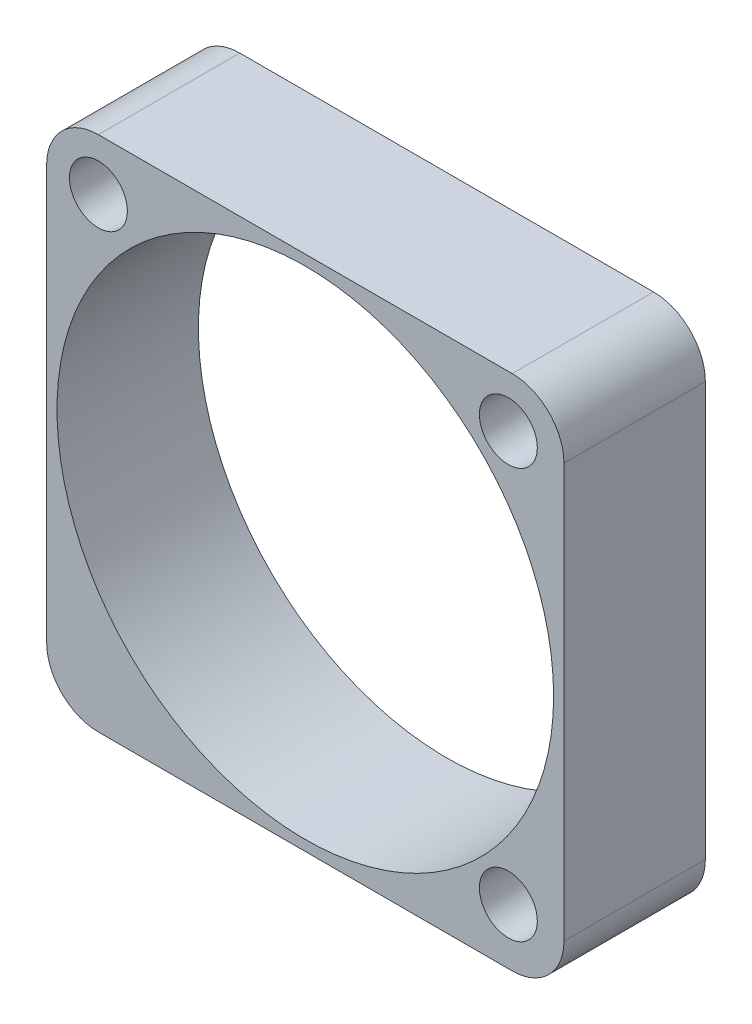
ISO-10303-21;
HEADER;
FILE_DESCRIPTION(('STEP AP214'),'2;1');
FILE_NAME('part.step','',(''),(''),'','','');
FILE_SCHEMA(('AUTOMOTIVE_DESIGN { 1 0 10303 214 1 1 1 1 }'));
ENDSEC;
DATA;
#1=APPLICATION_CONTEXT('core data for automotive mechanical design processes');
#2=APPLICATION_PROTOCOL_DEFINITION('international standard','automotive_design',2000,#1);
#3=PRODUCT_CONTEXT('',#1,'mechanical');
#4=PRODUCT('Part','Part','',(#3));
#5=PRODUCT_RELATED_PRODUCT_CATEGORY('part','',(#4));
#6=PRODUCT_DEFINITION_FORMATION('','',#4);
#7=PRODUCT_DEFINITION_CONTEXT('part definition',#1,'design');
#8=PRODUCT_DEFINITION('design','',#6,#7);
#9=PRODUCT_DEFINITION_SHAPE('','',#8);
#10=(LENGTH_UNIT() NAMED_UNIT(*) SI_UNIT(.MILLI.,.METRE.));
#11=(NAMED_UNIT(*) PLANE_ANGLE_UNIT() SI_UNIT($,.RADIAN.));
#12=(NAMED_UNIT(*) SI_UNIT($,.STERADIAN.) SOLID_ANGLE_UNIT());
#13=UNCERTAINTY_MEASURE_WITH_UNIT(LENGTH_MEASURE(1.E-05),#10,'distance_accuracy_value','');
#14=(GEOMETRIC_REPRESENTATION_CONTEXT(3) GLOBAL_UNCERTAINTY_ASSIGNED_CONTEXT((#13)) GLOBAL_UNIT_ASSIGNED_CONTEXT((#10,
#11,#12)) REPRESENTATION_CONTEXT('',''));
#15=CARTESIAN_POINT('',(0.,0.,0.));
#16=DIRECTION('',(0.,0.,1.));
#17=DIRECTION('',(1.,0.,0.));
#18=AXIS2_PLACEMENT_3D('',#15,#16,#17);
#19=CARTESIAN_POINT('',(0.,0.,6.8325));
#20=DIRECTION('',(1.,0.,0.));
#21=DIRECTION('',(0.,0.,-1.));
#22=AXIS2_PLACEMENT_3D('',#19,#20,#21);
#23=PLANE('',#22);
#24=DIRECTION('',(0.,-1.,0.));
#25=VECTOR('',#24,1.);
#26=CARTESIAN_POINT('',(0.,0.,0.));
#27=LINE('',#26,#25);
#28=CARTESIAN_POINT('',(0.,22.5,0.));
#29=VERTEX_POINT('',#28);
#30=CARTESIAN_POINT('',(0.,2.5,0.));
#31=VERTEX_POINT('',#30);
#32=EDGE_CURVE('E127',#29,#31,#27,.T.);
#33=ORIENTED_EDGE('',*,*,#32,.T.);
#34=DIRECTION('',(0.,0.,-1.));
#35=VECTOR('',#34,1.);
#36=CARTESIAN_POINT('',(0.,2.5,6.8325));
#37=LINE('',#36,#35);
#38=CARTESIAN_POINT('',(0.,2.5,6.8325));
#39=VERTEX_POINT('',#38);
#40=EDGE_CURVE('E105',#31,#39,#37,.F.);
#41=ORIENTED_EDGE('',*,*,#40,.T.);
#42=DIRECTION('',(0.,-1.,0.));
#43=VECTOR('',#42,1.);
#44=CARTESIAN_POINT('',(0.,0.,6.8325));
#45=LINE('',#44,#43);
#46=CARTESIAN_POINT('',(0.,22.5,6.8325));
#47=VERTEX_POINT('',#46);
#48=EDGE_CURVE('E137',#47,#39,#45,.T.);
#49=ORIENTED_EDGE('',*,*,#48,.F.);
#50=DIRECTION('',(0.,0.,-1.));
#51=VECTOR('',#50,1.);
#52=CARTESIAN_POINT('',(0.,22.5,6.8325));
#53=LINE('',#52,#51);
#54=EDGE_CURVE('E110',#47,#29,#53,.T.);
#55=ORIENTED_EDGE('',*,*,#54,.T.);
#56=EDGE_LOOP('',(#33,#41,#49,#55));
#57=FACE_BOUND('',#56,.T.);
#58=ADVANCED_FACE('F34',(#57),#23,.F.);
#59=CARTESIAN_POINT('',(0.,0.,6.8325));
#60=DIRECTION('',(0.,1.,0.));
#61=DIRECTION('',(0.,0.,1.));
#62=AXIS2_PLACEMENT_3D('',#59,#60,#61);
#63=PLANE('',#62);
#64=DIRECTION('',(1.,0.,0.));
#65=VECTOR('',#64,1.);
#66=CARTESIAN_POINT('',(0.,0.,6.8325));
#67=LINE('',#66,#65);
#68=CARTESIAN_POINT('',(2.5,0.,6.8325));
#69=VERTEX_POINT('',#68);
#70=CARTESIAN_POINT('',(22.5,0.,6.8325));
#71=VERTEX_POINT('',#70);
#72=EDGE_CURVE('E120',#69,#71,#67,.T.);
#73=ORIENTED_EDGE('',*,*,#72,.F.);
#74=DIRECTION('',(0.,0.,-1.));
#75=VECTOR('',#74,1.);
#76=CARTESIAN_POINT('',(2.5,0.,6.8325));
#77=LINE('',#76,#75);
#78=CARTESIAN_POINT('',(2.5,0.,0.));
#79=VERTEX_POINT('',#78);
#80=EDGE_CURVE('E104',#69,#79,#77,.T.);
#81=ORIENTED_EDGE('',*,*,#80,.T.);
#82=DIRECTION('',(1.,0.,0.));
#83=VECTOR('',#82,1.);
#84=CARTESIAN_POINT('',(0.,0.,0.));
#85=LINE('',#84,#83);
#86=CARTESIAN_POINT('',(22.5,0.,0.));
#87=VERTEX_POINT('',#86);
#88=EDGE_CURVE('E117',#79,#87,#85,.T.);
#89=ORIENTED_EDGE('',*,*,#88,.T.);
#90=DIRECTION('',(0.,0.,-1.));
#91=VECTOR('',#90,1.);
#92=CARTESIAN_POINT('',(22.5,0.,6.8325));
#93=LINE('',#92,#91);
#94=EDGE_CURVE('E122',#87,#71,#93,.F.);
#95=ORIENTED_EDGE('',*,*,#94,.T.);
#96=EDGE_LOOP('',(#73,#81,#89,#95));
#97=FACE_BOUND('',#96,.T.);
#98=ADVANCED_FACE('F116',(#97),#63,.F.);
#99=CARTESIAN_POINT('',(25.,0.,6.8325));
#100=DIRECTION('',(-1.,0.,0.));
#101=DIRECTION('',(0.,0.,1.));
#102=AXIS2_PLACEMENT_3D('',#99,#100,#101);
#103=PLANE('',#102);
#104=DIRECTION('',(0.,1.,0.));
#105=VECTOR('',#104,1.);
#106=CARTESIAN_POINT('',(25.,0.,6.8325));
#107=LINE('',#106,#105);
#108=CARTESIAN_POINT('',(25.,2.5,6.8325));
#109=VERTEX_POINT('',#108);
#110=CARTESIAN_POINT('',(25.,22.5,6.8325));
#111=VERTEX_POINT('',#110);
#112=EDGE_CURVE('E163',#109,#111,#107,.T.);
#113=ORIENTED_EDGE('',*,*,#112,.F.);
#114=DIRECTION('',(0.,0.,-1.));
#115=VECTOR('',#114,1.);
#116=CARTESIAN_POINT('',(25.,2.5,6.8325));
#117=LINE('',#116,#115);
#118=CARTESIAN_POINT('',(25.,2.5,0.));
#119=VERTEX_POINT('',#118);
#120=EDGE_CURVE('E156',#109,#119,#117,.T.);
#121=ORIENTED_EDGE('',*,*,#120,.T.);
#122=DIRECTION('',(0.,1.,0.));
#123=VECTOR('',#122,1.);
#124=CARTESIAN_POINT('',(25.,0.,0.));
#125=LINE('',#124,#123);
#126=CARTESIAN_POINT('',(25.,22.5,0.));
#127=VERTEX_POINT('',#126);
#128=EDGE_CURVE('E126',#119,#127,#125,.T.);
#129=ORIENTED_EDGE('',*,*,#128,.T.);
#130=DIRECTION('',(0.,0.,-1.));
#131=VECTOR('',#130,1.);
#132=CARTESIAN_POINT('',(25.,22.5,6.8325));
#133=LINE('',#132,#131);
#134=EDGE_CURVE('E154',#127,#111,#133,.F.);
#135=ORIENTED_EDGE('',*,*,#134,.T.);
#136=EDGE_LOOP('',(#113,#121,#129,#135));
#137=FACE_BOUND('',#136,.T.);
#138=ADVANCED_FACE('F161',(#137),#103,.F.);
#139=CARTESIAN_POINT('',(0.,25.,6.8325));
#140=DIRECTION('',(0.,-1.,0.));
#141=DIRECTION('',(0.,0.,-1.));
#142=AXIS2_PLACEMENT_3D('',#139,#140,#141);
#143=PLANE('',#142);
#144=DIRECTION('',(-1.,0.,0.));
#145=VECTOR('',#144,1.);
#146=CARTESIAN_POINT('',(0.,25.,6.8325));
#147=LINE('',#146,#145);
#148=CARTESIAN_POINT('',(22.5,25.,6.8325));
#149=VERTEX_POINT('',#148);
#150=CARTESIAN_POINT('',(2.5,25.,6.8325));
#151=VERTEX_POINT('',#150);
#152=EDGE_CURVE('E138',#149,#151,#147,.T.);
#153=ORIENTED_EDGE('',*,*,#152,.F.);
#154=DIRECTION('',(0.,0.,-1.));
#155=VECTOR('',#154,1.);
#156=CARTESIAN_POINT('',(22.5,25.,6.8325));
#157=LINE('',#156,#155);
#158=CARTESIAN_POINT('',(22.5,25.,0.));
#159=VERTEX_POINT('',#158);
#160=EDGE_CURVE('E11',#149,#159,#157,.T.);
#161=ORIENTED_EDGE('',*,*,#160,.T.);
#162=DIRECTION('',(-1.,0.,0.));
#163=VECTOR('',#162,1.);
#164=CARTESIAN_POINT('',(0.,25.,0.));
#165=LINE('',#164,#163);
#166=CARTESIAN_POINT('',(2.5,25.,0.));
#167=VERTEX_POINT('',#166);
#168=EDGE_CURVE('E130',#159,#167,#165,.T.);
#169=ORIENTED_EDGE('',*,*,#168,.T.);
#170=DIRECTION('',(0.,0.,-1.));
#171=VECTOR('',#170,1.);
#172=CARTESIAN_POINT('',(2.5,25.,6.8325));
#173=LINE('',#172,#171);
#174=EDGE_CURVE('E42',#167,#151,#173,.F.);
#175=ORIENTED_EDGE('',*,*,#174,.T.);
#176=EDGE_LOOP('',(#153,#161,#169,#175));
#177=FACE_BOUND('',#176,.T.);
#178=ADVANCED_FACE('F170',(#177),#143,.F.);
#179=CARTESIAN_POINT('',(0.,0.,6.8325));
#180=DIRECTION('',(0.,0.,-1.));
#181=DIRECTION('',(-1.,0.,0.));
#182=AXIS2_PLACEMENT_3D('',#179,#180,#181);
#183=PLANE('',#182);
#184=CARTESIAN_POINT('',(22.312,2.68799999999999,6.8325));
#185=DIRECTION('',(0.,0.,1.));
#186=DIRECTION('',(1.,0.,0.));
#187=AXIS2_PLACEMENT_3D('',#184,#185,#186);
#188=CIRCLE('',#187,1.4);
#189=CARTESIAN_POINT('',(23.712,2.68799999999999,6.8325));
#190=VERTEX_POINT('',#189);
#191=EDGE_CURVE('E195',#190,#190,#188,.T.);
#192=ORIENTED_EDGE('',*,*,#191,.F.);
#193=EDGE_LOOP('',(#192));
#194=FACE_BOUND('',#193,.T.);
#195=CARTESIAN_POINT('',(22.312,22.5,6.8325));
#196=DIRECTION('',(0.,0.,1.));
#197=DIRECTION('',(1.,0.,0.));
#198=AXIS2_PLACEMENT_3D('',#195,#196,#197);
#199=CIRCLE('',#198,1.4);
#200=CARTESIAN_POINT('',(23.712,22.5,6.8325));
#201=VERTEX_POINT('',#200);
#202=EDGE_CURVE('E189',#201,#201,#199,.T.);
#203=ORIENTED_EDGE('',*,*,#202,.F.);
#204=EDGE_LOOP('',(#203));
#205=FACE_BOUND('',#204,.T.);
#206=CARTESIAN_POINT('',(2.5,22.5,6.8325));
#207=DIRECTION('',(0.,0.,1.));
#208=DIRECTION('',(1.,0.,0.));
#209=AXIS2_PLACEMENT_3D('',#206,#207,#208);
#210=CIRCLE('',#209,1.4);
#211=CARTESIAN_POINT('',(3.9,22.5,6.8325));
#212=VERTEX_POINT('',#211);
#213=EDGE_CURVE('E183',#212,#212,#210,.T.);
#214=ORIENTED_EDGE('',*,*,#213,.F.);
#215=EDGE_LOOP('',(#214));
#216=FACE_BOUND('',#215,.T.);
#217=CARTESIAN_POINT('',(12.5,12.5,6.8325));
#218=DIRECTION('',(0.,0.,1.));
#219=DIRECTION('',(1.,0.,0.));
#220=AXIS2_PLACEMENT_3D('',#217,#218,#219);
#221=CIRCLE('',#220,12.);
#222=CARTESIAN_POINT('',(24.5,12.5,6.8325));
#223=VERTEX_POINT('',#222);
#224=EDGE_CURVE('E177',#223,#223,#221,.T.);
#225=ORIENTED_EDGE('',*,*,#224,.F.);
#226=EDGE_LOOP('',(#225));
#227=FACE_BOUND('',#226,.T.);
#228=ORIENTED_EDGE('',*,*,#48,.T.);
#229=CARTESIAN_POINT('',(2.5,2.5,6.8325));
#230=DIRECTION('',(0.,0.,-1.));
#231=DIRECTION('',(-1.,0.,0.));
#232=AXIS2_PLACEMENT_3D('',#229,#230,#231);
#233=CIRCLE('',#232,2.5);
#234=EDGE_CURVE('E152',#39,#69,#233,.F.);
#235=ORIENTED_EDGE('',*,*,#234,.T.);
#236=ORIENTED_EDGE('',*,*,#72,.T.);
#237=CARTESIAN_POINT('',(22.5,2.5,6.8325));
#238=DIRECTION('',(0.,0.,-1.));
#239=DIRECTION('',(-1.,0.,0.));
#240=AXIS2_PLACEMENT_3D('',#237,#238,#239);
#241=CIRCLE('',#240,2.5);
#242=EDGE_CURVE('E150',#71,#109,#241,.F.);
#243=ORIENTED_EDGE('',*,*,#242,.T.);
#244=ORIENTED_EDGE('',*,*,#112,.T.);
#245=CARTESIAN_POINT('',(22.5,22.5,6.8325));
#246=DIRECTION('',(0.,0.,-1.));
#247=DIRECTION('',(-1.,0.,0.));
#248=AXIS2_PLACEMENT_3D('',#245,#246,#247);
#249=CIRCLE('',#248,2.5);
#250=EDGE_CURVE('E55',#111,#149,#249,.F.);
#251=ORIENTED_EDGE('',*,*,#250,.T.);
#252=ORIENTED_EDGE('',*,*,#152,.T.);
#253=CARTESIAN_POINT('',(2.5,22.5,6.8325));
#254=DIRECTION('',(0.,0.,-1.));
#255=DIRECTION('',(-1.,0.,0.));
#256=AXIS2_PLACEMENT_3D('',#253,#254,#255);
#257=CIRCLE('',#256,2.5);
#258=EDGE_CURVE('E147',#151,#47,#257,.F.);
#259=ORIENTED_EDGE('',*,*,#258,.T.);
#260=EDGE_LOOP('',(#228,#235,#236,#243,#244,#251,#252,#259));
#261=FACE_BOUND('',#260,.T.);
#262=ADVANCED_FACE('F210',(#194,#205,#216,#227,#261),#183,.F.);
#263=CARTESIAN_POINT('',(0.,0.,0.));
#264=DIRECTION('',(0.,0.,-1.));
#265=DIRECTION('',(-1.,0.,0.));
#266=AXIS2_PLACEMENT_3D('',#263,#264,#265);
#267=PLANE('',#266);
#268=CARTESIAN_POINT('',(22.312,2.68799999999999,0.));
#269=DIRECTION('',(0.,0.,1.));
#270=DIRECTION('',(1.,0.,0.));
#271=AXIS2_PLACEMENT_3D('',#268,#269,#270);
#272=CIRCLE('',#271,1.4);
#273=CARTESIAN_POINT('',(23.712,2.68799999999999,0.));
#274=VERTEX_POINT('',#273);
#275=EDGE_CURVE('E192',#274,#274,#272,.T.);
#276=ORIENTED_EDGE('',*,*,#275,.T.);
#277=EDGE_LOOP('',(#276));
#278=FACE_BOUND('',#277,.T.);
#279=CARTESIAN_POINT('',(22.312,22.5,0.));
#280=DIRECTION('',(0.,0.,1.));
#281=DIRECTION('',(1.,0.,0.));
#282=AXIS2_PLACEMENT_3D('',#279,#280,#281);
#283=CIRCLE('',#282,1.4);
#284=CARTESIAN_POINT('',(23.712,22.5,0.));
#285=VERTEX_POINT('',#284);
#286=EDGE_CURVE('E186',#285,#285,#283,.T.);
#287=ORIENTED_EDGE('',*,*,#286,.T.);
#288=EDGE_LOOP('',(#287));
#289=FACE_BOUND('',#288,.T.);
#290=CARTESIAN_POINT('',(2.5,22.5,0.));
#291=DIRECTION('',(0.,0.,1.));
#292=DIRECTION('',(1.,0.,0.));
#293=AXIS2_PLACEMENT_3D('',#290,#291,#292);
#294=CIRCLE('',#293,1.4);
#295=CARTESIAN_POINT('',(3.9,22.5,0.));
#296=VERTEX_POINT('',#295);
#297=EDGE_CURVE('E180',#296,#296,#294,.T.);
#298=ORIENTED_EDGE('',*,*,#297,.T.);
#299=EDGE_LOOP('',(#298));
#300=FACE_BOUND('',#299,.T.);
#301=CARTESIAN_POINT('',(12.5,12.5,0.));
#302=DIRECTION('',(0.,0.,1.));
#303=DIRECTION('',(1.,0.,0.));
#304=AXIS2_PLACEMENT_3D('',#301,#302,#303);
#305=CIRCLE('',#304,12.);
#306=CARTESIAN_POINT('',(24.5,12.5,0.));
#307=VERTEX_POINT('',#306);
#308=EDGE_CURVE('E132',#307,#307,#305,.T.);
#309=ORIENTED_EDGE('',*,*,#308,.T.);
#310=EDGE_LOOP('',(#309));
#311=FACE_BOUND('',#310,.T.);
#312=ORIENTED_EDGE('',*,*,#88,.F.);
#313=CARTESIAN_POINT('',(2.5,2.5,0.));
#314=DIRECTION('',(0.,0.,-1.));
#315=DIRECTION('',(-1.,0.,0.));
#316=AXIS2_PLACEMENT_3D('',#313,#314,#315);
#317=CIRCLE('',#316,2.5);
#318=EDGE_CURVE('E100',#79,#31,#317,.T.);
#319=ORIENTED_EDGE('',*,*,#318,.T.);
#320=ORIENTED_EDGE('',*,*,#32,.F.);
#321=CARTESIAN_POINT('',(2.5,22.5,0.));
#322=DIRECTION('',(0.,0.,-1.));
#323=DIRECTION('',(-1.,0.,0.));
#324=AXIS2_PLACEMENT_3D('',#321,#322,#323);
#325=CIRCLE('',#324,2.5);
#326=EDGE_CURVE('E121',#29,#167,#325,.T.);
#327=ORIENTED_EDGE('',*,*,#326,.T.);
#328=ORIENTED_EDGE('',*,*,#168,.F.);
#329=CARTESIAN_POINT('',(22.5,22.5,0.));
#330=DIRECTION('',(0.,0.,-1.));
#331=DIRECTION('',(-1.,0.,0.));
#332=AXIS2_PLACEMENT_3D('',#329,#330,#331);
#333=CIRCLE('',#332,2.5);
#334=EDGE_CURVE('E141',#159,#127,#333,.T.);
#335=ORIENTED_EDGE('',*,*,#334,.T.);
#336=ORIENTED_EDGE('',*,*,#128,.F.);
#337=CARTESIAN_POINT('',(22.5,2.5,0.));
#338=DIRECTION('',(0.,0.,-1.));
#339=DIRECTION('',(-1.,0.,0.));
#340=AXIS2_PLACEMENT_3D('',#337,#338,#339);
#341=CIRCLE('',#340,2.5);
#342=EDGE_CURVE('E111',#119,#87,#341,.T.);
#343=ORIENTED_EDGE('',*,*,#342,.T.);
#344=EDGE_LOOP('',(#312,#319,#320,#327,#328,#335,#336,#343));
#345=FACE_BOUND('',#344,.T.);
#346=ADVANCED_FACE('F124',(#278,#289,#300,#311,#345),#267,.T.);
#347=CARTESIAN_POINT('',(12.5,12.5,0.));
#348=DIRECTION('',(0.,0.,1.));
#349=DIRECTION('',(1.,0.,0.));
#350=AXIS2_PLACEMENT_3D('',#347,#348,#349);
#351=CYLINDRICAL_SURFACE('',#350,12.);
#352=ORIENTED_EDGE('',*,*,#308,.F.);
#353=EDGE_LOOP('',(#352));
#354=FACE_BOUND('',#353,.T.);
#355=ORIENTED_EDGE('',*,*,#224,.T.);
#356=EDGE_LOOP('',(#355));
#357=FACE_BOUND('',#356,.T.);
#358=ADVANCED_FACE('F282',(#354,#357),#351,.F.);
#359=CARTESIAN_POINT('',(2.5,22.5,0.));
#360=DIRECTION('',(0.,0.,1.));
#361=DIRECTION('',(1.,0.,0.));
#362=AXIS2_PLACEMENT_3D('',#359,#360,#361);
#363=CYLINDRICAL_SURFACE('',#362,1.4);
#364=ORIENTED_EDGE('',*,*,#297,.F.);
#365=EDGE_LOOP('',(#364));
#366=FACE_BOUND('',#365,.T.);
#367=ORIENTED_EDGE('',*,*,#213,.T.);
#368=EDGE_LOOP('',(#367));
#369=FACE_BOUND('',#368,.T.);
#370=ADVANCED_FACE('F273',(#366,#369),#363,.F.);
#371=CARTESIAN_POINT('',(22.312,22.5,0.));
#372=DIRECTION('',(0.,0.,1.));
#373=DIRECTION('',(1.,0.,0.));
#374=AXIS2_PLACEMENT_3D('',#371,#372,#373);
#375=CYLINDRICAL_SURFACE('',#374,1.4);
#376=ORIENTED_EDGE('',*,*,#286,.F.);
#377=EDGE_LOOP('',(#376));
#378=FACE_BOUND('',#377,.T.);
#379=ORIENTED_EDGE('',*,*,#202,.T.);
#380=EDGE_LOOP('',(#379));
#381=FACE_BOUND('',#380,.T.);
#382=ADVANCED_FACE('F206',(#378,#381),#375,.F.);
#383=CARTESIAN_POINT('',(22.312,2.68799999999999,0.));
#384=DIRECTION('',(0.,0.,1.));
#385=DIRECTION('',(1.,0.,0.));
#386=AXIS2_PLACEMENT_3D('',#383,#384,#385);
#387=CYLINDRICAL_SURFACE('',#386,1.4);
#388=ORIENTED_EDGE('',*,*,#275,.F.);
#389=EDGE_LOOP('',(#388));
#390=FACE_BOUND('',#389,.T.);
#391=ORIENTED_EDGE('',*,*,#191,.T.);
#392=EDGE_LOOP('',(#391));
#393=FACE_BOUND('',#392,.T.);
#394=ADVANCED_FACE('F203',(#390,#393),#387,.F.);
#395=CARTESIAN_POINT('',(2.5,2.5,6.8325));
#396=DIRECTION('',(0.,0.,-1.));
#397=DIRECTION('',(-1.,0.,0.));
#398=AXIS2_PLACEMENT_3D('',#395,#396,#397);
#399=CYLINDRICAL_SURFACE('',#398,2.5);
#400=ORIENTED_EDGE('',*,*,#234,.F.);
#401=ORIENTED_EDGE('',*,*,#40,.F.);
#402=ORIENTED_EDGE('',*,*,#318,.F.);
#403=ORIENTED_EDGE('',*,*,#80,.F.);
#404=EDGE_LOOP('',(#400,#401,#402,#403));
#405=FACE_BOUND('',#404,.T.);
#406=ADVANCED_FACE('F103',(#405),#399,.T.);
#407=CARTESIAN_POINT('',(22.5,2.5,6.8325));
#408=DIRECTION('',(0.,0.,-1.));
#409=DIRECTION('',(-1.,0.,0.));
#410=AXIS2_PLACEMENT_3D('',#407,#408,#409);
#411=CYLINDRICAL_SURFACE('',#410,2.5);
#412=ORIENTED_EDGE('',*,*,#242,.F.);
#413=ORIENTED_EDGE('',*,*,#94,.F.);
#414=ORIENTED_EDGE('',*,*,#342,.F.);
#415=ORIENTED_EDGE('',*,*,#120,.F.);
#416=EDGE_LOOP('',(#412,#413,#414,#415));
#417=FACE_BOUND('',#416,.T.);
#418=ADVANCED_FACE('F227',(#417),#411,.T.);
#419=CARTESIAN_POINT('',(22.5,22.5,6.8325));
#420=DIRECTION('',(0.,0.,-1.));
#421=DIRECTION('',(-1.,0.,0.));
#422=AXIS2_PLACEMENT_3D('',#419,#420,#421);
#423=CYLINDRICAL_SURFACE('',#422,2.5);
#424=ORIENTED_EDGE('',*,*,#250,.F.);
#425=ORIENTED_EDGE('',*,*,#134,.F.);
#426=ORIENTED_EDGE('',*,*,#334,.F.);
#427=ORIENTED_EDGE('',*,*,#160,.F.);
#428=EDGE_LOOP('',(#424,#425,#426,#427));
#429=FACE_BOUND('',#428,.T.);
#430=ADVANCED_FACE('F169',(#429),#423,.T.);
#431=CARTESIAN_POINT('',(2.5,22.5,6.8325));
#432=DIRECTION('',(0.,0.,-1.));
#433=DIRECTION('',(-1.,0.,0.));
#434=AXIS2_PLACEMENT_3D('',#431,#432,#433);
#435=CYLINDRICAL_SURFACE('',#434,2.5);
#436=ORIENTED_EDGE('',*,*,#258,.F.);
#437=ORIENTED_EDGE('',*,*,#174,.F.);
#438=ORIENTED_EDGE('',*,*,#326,.F.);
#439=ORIENTED_EDGE('',*,*,#54,.F.);
#440=EDGE_LOOP('',(#436,#437,#438,#439));
#441=FACE_BOUND('',#440,.T.);
#442=ADVANCED_FACE('F36',(#441),#435,.T.);
#443=CLOSED_SHELL('',(#58,#98,#138,#178,#262,#346,#358,#370,#382,#394,#406,#418,#430,#442));
#444=MANIFOLD_SOLID_BREP('B2',#443);
#445=ADVANCED_BREP_SHAPE_REPRESENTATION('',(#18,#444),#14);
#446=SHAPE_DEFINITION_REPRESENTATION(#9,#445);
ENDSEC;
END-ISO-10303-21;
